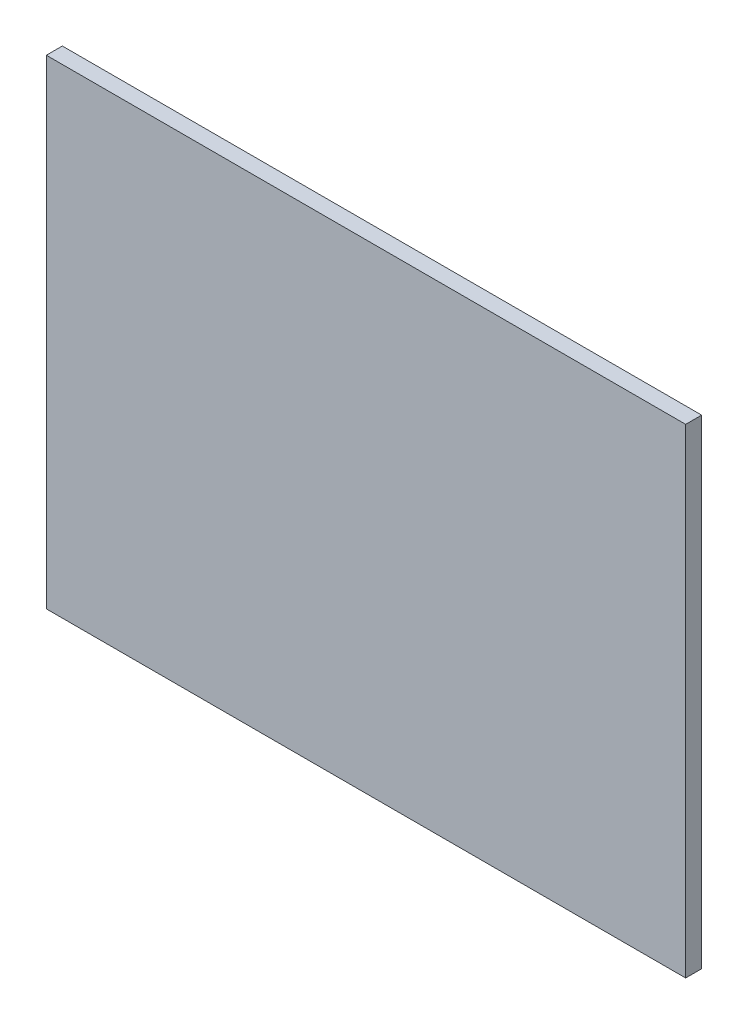
ISO-10303-21;
HEADER;
FILE_DESCRIPTION(('STEP AP214'),'2;1');
FILE_NAME('part.step','',(''),(''),'','','');
FILE_SCHEMA(('AUTOMOTIVE_DESIGN { 1 0 10303 214 1 1 1 1 }'));
ENDSEC;
DATA;
#1=APPLICATION_CONTEXT('core data for automotive mechanical design processes');
#2=APPLICATION_PROTOCOL_DEFINITION('international standard','automotive_design',2000,#1);
#3=PRODUCT_CONTEXT('',#1,'mechanical');
#4=PRODUCT('Part','Part','',(#3));
#5=PRODUCT_RELATED_PRODUCT_CATEGORY('part','',(#4));
#6=PRODUCT_DEFINITION_FORMATION('','',#4);
#7=PRODUCT_DEFINITION_CONTEXT('part definition',#1,'design');
#8=PRODUCT_DEFINITION('design','',#6,#7);
#9=PRODUCT_DEFINITION_SHAPE('','',#8);
#10=(LENGTH_UNIT() NAMED_UNIT(*) SI_UNIT(.MILLI.,.METRE.));
#11=(NAMED_UNIT(*) PLANE_ANGLE_UNIT() SI_UNIT($,.RADIAN.));
#12=(NAMED_UNIT(*) SI_UNIT($,.STERADIAN.) SOLID_ANGLE_UNIT());
#13=UNCERTAINTY_MEASURE_WITH_UNIT(LENGTH_MEASURE(1.E-05),#10,'distance_accuracy_value','');
#14=(GEOMETRIC_REPRESENTATION_CONTEXT(3) GLOBAL_UNCERTAINTY_ASSIGNED_CONTEXT((#13)) GLOBAL_UNIT_ASSIGNED_CONTEXT((#10,
#11,#12)) REPRESENTATION_CONTEXT('',''));
#15=CARTESIAN_POINT('',(0.,0.,0.));
#16=DIRECTION('',(0.,0.,1.));
#17=DIRECTION('',(1.,0.,0.));
#18=AXIS2_PLACEMENT_3D('',#15,#16,#17);
#19=CARTESIAN_POINT('',(343.417429749213,23.7371927745718,10.));
#20=DIRECTION('',(0.,-1.,0.));
#21=DIRECTION('',(1.,0.,0.));
#22=AXIS2_PLACEMENT_3D('',#19,#20,#21);
#23=PLANE('',#22);
#24=DIRECTION('',(-1.,0.,0.));
#25=VECTOR('',#24,1.);
#26=CARTESIAN_POINT('',(343.417429749213,23.7371927745718,0.));
#27=LINE('',#26,#25);
#28=CARTESIAN_POINT('',(343.417429749213,23.7371927745718,0.));
#29=VERTEX_POINT('',#28);
#30=CARTESIAN_POINT('',(-56.5825702507872,23.7371927745717,0.));
#31=VERTEX_POINT('',#30);
#32=EDGE_CURVE('E98',#29,#31,#27,.T.);
#33=ORIENTED_EDGE('',*,*,#32,.T.);
#34=DIRECTION('',(0.,0.,-1.));
#35=VECTOR('',#34,1.);
#36=CARTESIAN_POINT('',(-56.5825702507872,23.7371927745717,10.));
#37=LINE('',#36,#35);
#38=CARTESIAN_POINT('',(-56.5825702507872,23.7371927745717,10.));
#39=VERTEX_POINT('',#38);
#40=EDGE_CURVE('E11',#39,#31,#37,.T.);
#41=ORIENTED_EDGE('',*,*,#40,.F.);
#42=DIRECTION('',(-1.,0.,0.));
#43=VECTOR('',#42,1.);
#44=CARTESIAN_POINT('',(343.417429749213,23.7371927745718,10.));
#45=LINE('',#44,#43);
#46=CARTESIAN_POINT('',(343.417429749213,23.7371927745718,10.));
#47=VERTEX_POINT('',#46);
#48=EDGE_CURVE('E86',#47,#39,#45,.T.);
#49=ORIENTED_EDGE('',*,*,#48,.F.);
#50=DIRECTION('',(0.,0.,-1.));
#51=VECTOR('',#50,1.);
#52=CARTESIAN_POINT('',(343.417429749213,23.7371927745718,10.));
#53=LINE('',#52,#51);
#54=EDGE_CURVE('E94',#47,#29,#53,.T.);
#55=ORIENTED_EDGE('',*,*,#54,.T.);
#56=EDGE_LOOP('',(#33,#41,#49,#55));
#57=FACE_BOUND('',#56,.T.);
#58=ADVANCED_FACE('F35',(#57),#23,.F.);
#59=CARTESIAN_POINT('',(-56.5825702507872,23.7371927745717,10.));
#60=DIRECTION('',(1.,0.,0.));
#61=DIRECTION('',(0.,0.,-1.));
#62=AXIS2_PLACEMENT_3D('',#59,#60,#61);
#63=PLANE('',#62);
#64=DIRECTION('',(0.,-1.,0.));
#65=VECTOR('',#64,1.);
#66=CARTESIAN_POINT('',(-56.5825702507872,23.7371927745717,0.));
#67=LINE('',#66,#65);
#68=CARTESIAN_POINT('',(-56.5825702507872,-276.262807225428,0.));
#69=VERTEX_POINT('',#68);
#70=EDGE_CURVE('E90',#31,#69,#67,.T.);
#71=ORIENTED_EDGE('',*,*,#70,.T.);
#72=DIRECTION('',(0.,0.,-1.));
#73=VECTOR('',#72,1.);
#74=CARTESIAN_POINT('',(-56.5825702507872,-276.262807225428,10.));
#75=LINE('',#74,#73);
#76=CARTESIAN_POINT('',(-56.5825702507872,-276.262807225428,10.));
#77=VERTEX_POINT('',#76);
#78=EDGE_CURVE('E43',#77,#69,#75,.T.);
#79=ORIENTED_EDGE('',*,*,#78,.F.);
#80=DIRECTION('',(0.,-1.,0.));
#81=VECTOR('',#80,1.);
#82=CARTESIAN_POINT('',(-56.5825702507872,23.7371927745717,10.));
#83=LINE('',#82,#81);
#84=EDGE_CURVE('E81',#39,#77,#83,.T.);
#85=ORIENTED_EDGE('',*,*,#84,.F.);
#86=ORIENTED_EDGE('',*,*,#40,.T.);
#87=EDGE_LOOP('',(#71,#79,#85,#86));
#88=FACE_BOUND('',#87,.T.);
#89=ADVANCED_FACE('F89',(#88),#63,.F.);
#90=CARTESIAN_POINT('',(-56.5825702507872,-276.262807225428,10.));
#91=DIRECTION('',(0.,1.,0.));
#92=DIRECTION('',(0.,0.,1.));
#93=AXIS2_PLACEMENT_3D('',#90,#91,#92);
#94=PLANE('',#93);
#95=DIRECTION('',(1.,0.,0.));
#96=VECTOR('',#95,1.);
#97=CARTESIAN_POINT('',(-56.5825702507872,-276.262807225428,0.));
#98=LINE('',#97,#96);
#99=CARTESIAN_POINT('',(343.417429749213,-276.262807225428,0.));
#100=VERTEX_POINT('',#99);
#101=EDGE_CURVE('E68',#69,#100,#98,.T.);
#102=ORIENTED_EDGE('',*,*,#101,.T.);
#103=DIRECTION('',(0.,0.,-1.));
#104=VECTOR('',#103,1.);
#105=CARTESIAN_POINT('',(343.417429749213,-276.262807225428,10.));
#106=LINE('',#105,#104);
#107=CARTESIAN_POINT('',(343.417429749213,-276.262807225428,10.));
#108=VERTEX_POINT('',#107);
#109=EDGE_CURVE('E91',#108,#100,#106,.T.);
#110=ORIENTED_EDGE('',*,*,#109,.F.);
#111=DIRECTION('',(1.,0.,0.));
#112=VECTOR('',#111,1.);
#113=CARTESIAN_POINT('',(-56.5825702507872,-276.262807225428,10.));
#114=LINE('',#113,#112);
#115=EDGE_CURVE('E84',#77,#108,#114,.T.);
#116=ORIENTED_EDGE('',*,*,#115,.F.);
#117=ORIENTED_EDGE('',*,*,#78,.T.);
#118=EDGE_LOOP('',(#102,#110,#116,#117));
#119=FACE_BOUND('',#118,.T.);
#120=ADVANCED_FACE('F92',(#119),#94,.F.);
#121=CARTESIAN_POINT('',(343.417429749213,-276.262807225428,10.));
#122=DIRECTION('',(-1.,0.,0.));
#123=DIRECTION('',(0.,0.,1.));
#124=AXIS2_PLACEMENT_3D('',#121,#122,#123);
#125=PLANE('',#124);
#126=DIRECTION('',(0.,1.,0.));
#127=VECTOR('',#126,1.);
#128=CARTESIAN_POINT('',(343.417429749213,-276.262807225428,0.));
#129=LINE('',#128,#127);
#130=EDGE_CURVE('E74',#100,#29,#129,.T.);
#131=ORIENTED_EDGE('',*,*,#130,.T.);
#132=ORIENTED_EDGE('',*,*,#54,.F.);
#133=DIRECTION('',(0.,1.,0.));
#134=VECTOR('',#133,1.);
#135=CARTESIAN_POINT('',(343.417429749213,-276.262807225428,10.));
#136=LINE('',#135,#134);
#137=EDGE_CURVE('E51',#108,#47,#136,.T.);
#138=ORIENTED_EDGE('',*,*,#137,.F.);
#139=ORIENTED_EDGE('',*,*,#109,.T.);
#140=EDGE_LOOP('',(#131,#132,#138,#139));
#141=FACE_BOUND('',#140,.T.);
#142=ADVANCED_FACE('F105',(#141),#125,.F.);
#143=CARTESIAN_POINT('',(0.,0.,10.));
#144=DIRECTION('',(0.,0.,1.));
#145=DIRECTION('',(1.,0.,0.));
#146=AXIS2_PLACEMENT_3D('',#143,#144,#145);
#147=PLANE('',#146);
#148=ORIENTED_EDGE('',*,*,#48,.T.);
#149=ORIENTED_EDGE('',*,*,#84,.T.);
#150=ORIENTED_EDGE('',*,*,#115,.T.);
#151=ORIENTED_EDGE('',*,*,#137,.T.);
#152=EDGE_LOOP('',(#148,#149,#150,#151));
#153=FACE_BOUND('',#152,.T.);
#154=ADVANCED_FACE('F82',(#153),#147,.T.);
#155=CARTESIAN_POINT('',(0.,0.,0.));
#156=DIRECTION('',(0.,0.,1.));
#157=DIRECTION('',(1.,0.,0.));
#158=AXIS2_PLACEMENT_3D('',#155,#156,#157);
#159=PLANE('',#158);
#160=ORIENTED_EDGE('',*,*,#32,.F.);
#161=ORIENTED_EDGE('',*,*,#130,.F.);
#162=ORIENTED_EDGE('',*,*,#101,.F.);
#163=ORIENTED_EDGE('',*,*,#70,.F.);
#164=EDGE_LOOP('',(#160,#161,#162,#163));
#165=FACE_BOUND('',#164,.T.);
#166=ADVANCED_FACE('F108',(#165),#159,.F.);
#167=CLOSED_SHELL('',(#58,#89,#120,#142,#154,#166));
#168=MANIFOLD_SOLID_BREP('B2',#167);
#169=ADVANCED_BREP_SHAPE_REPRESENTATION('',(#18,#168),#14);
#170=SHAPE_DEFINITION_REPRESENTATION(#9,#169);
ENDSEC;
END-ISO-10303-21;
